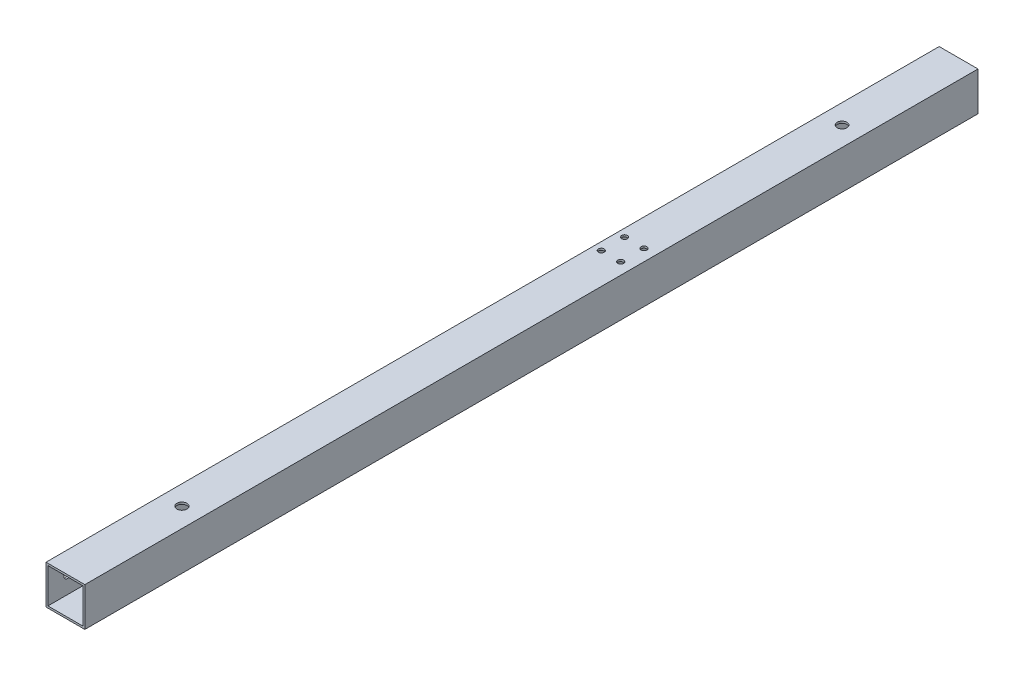
ISO-10303-21;
HEADER;
FILE_DESCRIPTION(('STEP AP214'),'2;1');
FILE_NAME('part.step','',(''),(''),'','','');
FILE_SCHEMA(('AUTOMOTIVE_DESIGN { 1 0 10303 214 1 1 1 1 }'));
ENDSEC;
DATA;
#1=APPLICATION_CONTEXT('core data for automotive mechanical design processes');
#2=APPLICATION_PROTOCOL_DEFINITION('international standard','automotive_design',2000,#1);
#3=PRODUCT_CONTEXT('',#1,'mechanical');
#4=PRODUCT('Part','Part','',(#3));
#5=PRODUCT_RELATED_PRODUCT_CATEGORY('part','',(#4));
#6=PRODUCT_DEFINITION_FORMATION('','',#4);
#7=PRODUCT_DEFINITION_CONTEXT('part definition',#1,'design');
#8=PRODUCT_DEFINITION('design','',#6,#7);
#9=PRODUCT_DEFINITION_SHAPE('','',#8);
#10=(LENGTH_UNIT() NAMED_UNIT(*) SI_UNIT(.MILLI.,.METRE.));
#11=(NAMED_UNIT(*) PLANE_ANGLE_UNIT() SI_UNIT($,.RADIAN.));
#12=(NAMED_UNIT(*) SI_UNIT($,.STERADIAN.) SOLID_ANGLE_UNIT());
#13=UNCERTAINTY_MEASURE_WITH_UNIT(LENGTH_MEASURE(1.E-05),#10,'distance_accuracy_value','');
#14=(GEOMETRIC_REPRESENTATION_CONTEXT(3) GLOBAL_UNCERTAINTY_ASSIGNED_CONTEXT((#13)) GLOBAL_UNIT_ASSIGNED_CONTEXT((#10,
#11,#12)) REPRESENTATION_CONTEXT('',''));
#15=CARTESIAN_POINT('',(0.,0.,0.));
#16=DIRECTION('',(0.,0.,1.));
#17=DIRECTION('',(1.,0.,0.));
#18=AXIS2_PLACEMENT_3D('',#15,#16,#17);
#19=CARTESIAN_POINT('',(0.,0.,460.));
#20=DIRECTION('',(0.,0.,1.));
#21=DIRECTION('',(1.,0.,0.));
#22=AXIS2_PLACEMENT_3D('',#19,#20,#21);
#23=PLANE('',#22);
#24=DIRECTION('',(0.,1.,0.));
#25=VECTOR('',#24,1.);
#26=CARTESIAN_POINT('',(10.,10.,460.));
#27=LINE('',#26,#25);
#28=CARTESIAN_POINT('',(10.,-10.,460.));
#29=VERTEX_POINT('',#28);
#30=CARTESIAN_POINT('',(10.,10.,460.));
#31=VERTEX_POINT('',#30);
#32=EDGE_CURVE('E144',#29,#31,#27,.T.);
#33=ORIENTED_EDGE('',*,*,#32,.T.);
#34=DIRECTION('',(-1.,0.,0.));
#35=VECTOR('',#34,1.);
#36=CARTESIAN_POINT('',(-10.,10.,460.));
#37=LINE('',#36,#35);
#38=CARTESIAN_POINT('',(-10.,10.,460.));
#39=VERTEX_POINT('',#38);
#40=EDGE_CURVE('E147',#31,#39,#37,.T.);
#41=ORIENTED_EDGE('',*,*,#40,.T.);
#42=DIRECTION('',(0.,-1.,0.));
#43=VECTOR('',#42,1.);
#44=CARTESIAN_POINT('',(-10.,10.,460.));
#45=LINE('',#44,#43);
#46=CARTESIAN_POINT('',(-10.,-10.,460.));
#47=VERTEX_POINT('',#46);
#48=EDGE_CURVE('E150',#39,#47,#45,.T.);
#49=ORIENTED_EDGE('',*,*,#48,.T.);
#50=DIRECTION('',(1.,0.,0.));
#51=VECTOR('',#50,1.);
#52=CARTESIAN_POINT('',(-10.,-10.,460.));
#53=LINE('',#52,#51);
#54=EDGE_CURVE('E152',#47,#29,#53,.T.);
#55=ORIENTED_EDGE('',*,*,#54,.T.);
#56=EDGE_LOOP('',(#33,#41,#49,#55));
#57=FACE_BOUND('',#56,.T.);
#58=DIRECTION('',(-1.,0.,0.));
#59=VECTOR('',#58,1.);
#60=CARTESIAN_POINT('',(-9.,9.,460.));
#61=LINE('',#60,#59);
#62=CARTESIAN_POINT('',(9.,9.,460.));
#63=VERTEX_POINT('',#62);
#64=CARTESIAN_POINT('',(-9.,9.,460.));
#65=VERTEX_POINT('',#64);
#66=EDGE_CURVE('E114',#63,#65,#61,.T.);
#67=ORIENTED_EDGE('',*,*,#66,.F.);
#68=DIRECTION('',(0.,1.,0.));
#69=VECTOR('',#68,1.);
#70=CARTESIAN_POINT('',(9.,9.,460.));
#71=LINE('',#70,#69);
#72=CARTESIAN_POINT('',(9.,-9.,460.));
#73=VERTEX_POINT('',#72);
#74=EDGE_CURVE('E106',#73,#63,#71,.T.);
#75=ORIENTED_EDGE('',*,*,#74,.F.);
#76=DIRECTION('',(1.,0.,0.));
#77=VECTOR('',#76,1.);
#78=CARTESIAN_POINT('',(-9.,-9.,460.));
#79=LINE('',#78,#77);
#80=CARTESIAN_POINT('',(-9.,-9.,460.));
#81=VERTEX_POINT('',#80);
#82=EDGE_CURVE('E128',#81,#73,#79,.T.);
#83=ORIENTED_EDGE('',*,*,#82,.F.);
#84=DIRECTION('',(0.,-1.,0.));
#85=VECTOR('',#84,1.);
#86=CARTESIAN_POINT('',(-9.,9.,460.));
#87=LINE('',#86,#85);
#88=EDGE_CURVE('E126',#65,#81,#87,.T.);
#89=ORIENTED_EDGE('',*,*,#88,.F.);
#90=EDGE_LOOP('',(#67,#75,#83,#89));
#91=FACE_BOUND('',#90,.T.);
#92=ADVANCED_FACE('F39',(#57,#91),#23,.T.);
#93=CARTESIAN_POINT('',(0.,0.,0.));
#94=DIRECTION('',(0.,0.,1.));
#95=DIRECTION('',(1.,0.,0.));
#96=AXIS2_PLACEMENT_3D('',#93,#94,#95);
#97=PLANE('',#96);
#98=DIRECTION('',(0.,1.,0.));
#99=VECTOR('',#98,1.);
#100=CARTESIAN_POINT('',(10.,10.,0.));
#101=LINE('',#100,#99);
#102=CARTESIAN_POINT('',(10.,-10.,0.));
#103=VERTEX_POINT('',#102);
#104=CARTESIAN_POINT('',(10.,10.,0.));
#105=VERTEX_POINT('',#104);
#106=EDGE_CURVE('E122',#103,#105,#101,.T.);
#107=ORIENTED_EDGE('',*,*,#106,.F.);
#108=DIRECTION('',(1.,0.,0.));
#109=VECTOR('',#108,1.);
#110=CARTESIAN_POINT('',(-10.,-10.,0.));
#111=LINE('',#110,#109);
#112=CARTESIAN_POINT('',(-10.,-10.,0.));
#113=VERTEX_POINT('',#112);
#114=EDGE_CURVE('E148',#113,#103,#111,.T.);
#115=ORIENTED_EDGE('',*,*,#114,.F.);
#116=DIRECTION('',(0.,-1.,0.));
#117=VECTOR('',#116,1.);
#118=CARTESIAN_POINT('',(-10.,10.,0.));
#119=LINE('',#118,#117);
#120=CARTESIAN_POINT('',(-10.,10.,0.));
#121=VERTEX_POINT('',#120);
#122=EDGE_CURVE('E159',#121,#113,#119,.T.);
#123=ORIENTED_EDGE('',*,*,#122,.F.);
#124=DIRECTION('',(-1.,0.,0.));
#125=VECTOR('',#124,1.);
#126=CARTESIAN_POINT('',(-10.,10.,0.));
#127=LINE('',#126,#125);
#128=EDGE_CURVE('E157',#105,#121,#127,.T.);
#129=ORIENTED_EDGE('',*,*,#128,.F.);
#130=EDGE_LOOP('',(#107,#115,#123,#129));
#131=FACE_BOUND('',#130,.T.);
#132=DIRECTION('',(0.,1.,0.));
#133=VECTOR('',#132,1.);
#134=CARTESIAN_POINT('',(9.,9.,0.));
#135=LINE('',#134,#133);
#136=CARTESIAN_POINT('',(9.,-9.,0.));
#137=VERTEX_POINT('',#136);
#138=CARTESIAN_POINT('',(9.,9.,0.));
#139=VERTEX_POINT('',#138);
#140=EDGE_CURVE('E64',#137,#139,#135,.T.);
#141=ORIENTED_EDGE('',*,*,#140,.T.);
#142=DIRECTION('',(-1.,0.,0.));
#143=VECTOR('',#142,1.);
#144=CARTESIAN_POINT('',(-9.,9.,0.));
#145=LINE('',#144,#143);
#146=CARTESIAN_POINT('',(-9.,9.,0.));
#147=VERTEX_POINT('',#146);
#148=EDGE_CURVE('E121',#139,#147,#145,.T.);
#149=ORIENTED_EDGE('',*,*,#148,.T.);
#150=DIRECTION('',(0.,-1.,0.));
#151=VECTOR('',#150,1.);
#152=CARTESIAN_POINT('',(-9.,9.,0.));
#153=LINE('',#152,#151);
#154=CARTESIAN_POINT('',(-9.,-9.,0.));
#155=VERTEX_POINT('',#154);
#156=EDGE_CURVE('E136',#147,#155,#153,.T.);
#157=ORIENTED_EDGE('',*,*,#156,.T.);
#158=DIRECTION('',(1.,0.,0.));
#159=VECTOR('',#158,1.);
#160=CARTESIAN_POINT('',(-9.,-9.,0.));
#161=LINE('',#160,#159);
#162=EDGE_CURVE('E115',#155,#137,#161,.T.);
#163=ORIENTED_EDGE('',*,*,#162,.T.);
#164=EDGE_LOOP('',(#141,#149,#157,#163));
#165=FACE_BOUND('',#164,.T.);
#166=ADVANCED_FACE('F277',(#131,#165),#97,.F.);
#167=CARTESIAN_POINT('',(10.,10.,460.));
#168=DIRECTION('',(-1.,0.,0.));
#169=DIRECTION('',(0.,0.,1.));
#170=AXIS2_PLACEMENT_3D('',#167,#168,#169);
#171=PLANE('',#170);
#172=ORIENTED_EDGE('',*,*,#106,.T.);
#173=DIRECTION('',(0.,0.,-1.));
#174=VECTOR('',#173,1.);
#175=CARTESIAN_POINT('',(10.,10.,460.));
#176=LINE('',#175,#174);
#177=EDGE_CURVE('E11',#31,#105,#176,.T.);
#178=ORIENTED_EDGE('',*,*,#177,.F.);
#179=ORIENTED_EDGE('',*,*,#32,.F.);
#180=DIRECTION('',(0.,0.,-1.));
#181=VECTOR('',#180,1.);
#182=CARTESIAN_POINT('',(10.,-10.,460.));
#183=LINE('',#182,#181);
#184=EDGE_CURVE('E154',#29,#103,#183,.T.);
#185=ORIENTED_EDGE('',*,*,#184,.T.);
#186=EDGE_LOOP('',(#172,#178,#179,#185));
#187=FACE_BOUND('',#186,.T.);
#188=ADVANCED_FACE('F41',(#187),#171,.F.);
#189=CARTESIAN_POINT('',(-10.,10.,460.));
#190=DIRECTION('',(0.,-1.,0.));
#191=DIRECTION('',(0.,0.,-1.));
#192=AXIS2_PLACEMENT_3D('',#189,#190,#191);
#193=PLANE('',#192);
#194=CARTESIAN_POINT('',(0.,10.,400.));
#195=DIRECTION('',(0.,-1.,0.));
#196=DIRECTION('',(0.,0.,-1.));
#197=AXIS2_PLACEMENT_3D('',#194,#195,#196);
#198=CIRCLE('',#197,2.6);
#199=CARTESIAN_POINT('',(0.,10.,397.4));
#200=VERTEX_POINT('',#199);
#201=EDGE_CURVE('E215',#200,#200,#198,.T.);
#202=ORIENTED_EDGE('',*,*,#201,.T.);
#203=EDGE_LOOP('',(#202));
#204=FACE_BOUND('',#203,.T.);
#205=CARTESIAN_POINT('',(0.,10.,60.));
#206=DIRECTION('',(0.,-1.,0.));
#207=DIRECTION('',(0.,0.,-1.));
#208=AXIS2_PLACEMENT_3D('',#205,#206,#207);
#209=CIRCLE('',#208,2.5);
#210=CARTESIAN_POINT('',(0.,10.,57.5));
#211=VERTEX_POINT('',#210);
#212=EDGE_CURVE('E203',#211,#211,#209,.T.);
#213=ORIENTED_EDGE('',*,*,#212,.T.);
#214=EDGE_LOOP('',(#213));
#215=FACE_BOUND('',#214,.T.);
#216=CARTESIAN_POINT('',(-6.00000000000231,10.,166.000000000001));
#217=DIRECTION('',(0.,1.,0.));
#218=DIRECTION('',(0.,0.,1.));
#219=AXIS2_PLACEMENT_3D('',#216,#217,#218);
#220=CIRCLE('',#219,1.50000000000001);
#221=CARTESIAN_POINT('',(-6.00000000000231,10.,167.500000000001));
#222=VERTEX_POINT('',#221);
#223=EDGE_CURVE('E230',#222,#222,#220,.T.);
#224=ORIENTED_EDGE('',*,*,#223,.F.);
#225=EDGE_LOOP('',(#224));
#226=FACE_BOUND('',#225,.T.);
#227=CARTESIAN_POINT('',(3.99999999999769,10.,178.000000000001));
#228=DIRECTION('',(0.,1.,0.));
#229=DIRECTION('',(0.,0.,1.));
#230=AXIS2_PLACEMENT_3D('',#227,#228,#229);
#231=CIRCLE('',#230,1.5);
#232=CARTESIAN_POINT('',(3.99999999999769,10.,179.500000000001));
#233=VERTEX_POINT('',#232);
#234=EDGE_CURVE('E223',#233,#233,#231,.T.);
#235=ORIENTED_EDGE('',*,*,#234,.F.);
#236=EDGE_LOOP('',(#235));
#237=FACE_BOUND('',#236,.T.);
#238=CARTESIAN_POINT('',(-6.00000000000231,10.,178.000000000001));
#239=DIRECTION('',(0.,1.,0.));
#240=DIRECTION('',(0.,0.,1.));
#241=AXIS2_PLACEMENT_3D('',#238,#239,#240);
#242=CIRCLE('',#241,1.5);
#243=CARTESIAN_POINT('',(-6.00000000000231,10.,179.500000000001));
#244=VERTEX_POINT('',#243);
#245=EDGE_CURVE('E207',#244,#244,#242,.T.);
#246=ORIENTED_EDGE('',*,*,#245,.F.);
#247=EDGE_LOOP('',(#246));
#248=FACE_BOUND('',#247,.T.);
#249=CARTESIAN_POINT('',(3.99999999999769,10.,166.000000000001));
#250=DIRECTION('',(0.,1.,0.));
#251=DIRECTION('',(0.,0.,1.));
#252=AXIS2_PLACEMENT_3D('',#249,#250,#251);
#253=CIRCLE('',#252,1.50000000000001);
#254=CARTESIAN_POINT('',(3.99999999999769,10.,167.500000000001));
#255=VERTEX_POINT('',#254);
#256=EDGE_CURVE('E229',#255,#255,#253,.T.);
#257=ORIENTED_EDGE('',*,*,#256,.F.);
#258=EDGE_LOOP('',(#257));
#259=FACE_BOUND('',#258,.T.);
#260=ORIENTED_EDGE('',*,*,#128,.T.);
#261=DIRECTION('',(0.,0.,-1.));
#262=VECTOR('',#261,1.);
#263=CARTESIAN_POINT('',(-10.,10.,460.));
#264=LINE('',#263,#262);
#265=EDGE_CURVE('E48',#39,#121,#264,.T.);
#266=ORIENTED_EDGE('',*,*,#265,.F.);
#267=ORIENTED_EDGE('',*,*,#40,.F.);
#268=ORIENTED_EDGE('',*,*,#177,.T.);
#269=EDGE_LOOP('',(#260,#266,#267,#268));
#270=FACE_BOUND('',#269,.T.);
#271=ADVANCED_FACE('F264',(#204,#215,#226,#237,#248,#259,#270),#193,.F.);
#272=CARTESIAN_POINT('',(-10.,10.,460.));
#273=DIRECTION('',(1.,0.,0.));
#274=DIRECTION('',(0.,1.,0.));
#275=AXIS2_PLACEMENT_3D('',#272,#273,#274);
#276=PLANE('',#275);
#277=CARTESIAN_POINT('',(-10.,0.,262.));
#278=DIRECTION('',(-1.,0.,0.));
#279=DIRECTION('',(0.,-1.,0.));
#280=AXIS2_PLACEMENT_3D('',#277,#278,#279);
#281=CIRCLE('',#280,1.80000000000001);
#282=CARTESIAN_POINT('',(-10.,-1.80000000000001,262.));
#283=VERTEX_POINT('',#282);
#284=EDGE_CURVE('E183',#283,#283,#281,.T.);
#285=ORIENTED_EDGE('',*,*,#284,.F.);
#286=EDGE_LOOP('',(#285));
#287=FACE_BOUND('',#286,.T.);
#288=CARTESIAN_POINT('',(-10.,0.,450.));
#289=DIRECTION('',(-1.,0.,0.));
#290=DIRECTION('',(0.,-1.,0.));
#291=AXIS2_PLACEMENT_3D('',#288,#289,#290);
#292=CIRCLE('',#291,1.80000000000001);
#293=CARTESIAN_POINT('',(-10.,-1.80000000000001,450.));
#294=VERTEX_POINT('',#293);
#295=EDGE_CURVE('E179',#294,#294,#292,.T.);
#296=ORIENTED_EDGE('',*,*,#295,.F.);
#297=EDGE_LOOP('',(#296));
#298=FACE_BOUND('',#297,.T.);
#299=CARTESIAN_POINT('',(-10.,0.,198.));
#300=DIRECTION('',(-1.,0.,0.));
#301=DIRECTION('',(0.,-1.,0.));
#302=AXIS2_PLACEMENT_3D('',#299,#300,#301);
#303=CIRCLE('',#302,1.80000000000001);
#304=CARTESIAN_POINT('',(-10.,-1.80000000000001,198.));
#305=VERTEX_POINT('',#304);
#306=EDGE_CURVE('E175',#305,#305,#303,.T.);
#307=ORIENTED_EDGE('',*,*,#306,.F.);
#308=EDGE_LOOP('',(#307));
#309=FACE_BOUND('',#308,.T.);
#310=CARTESIAN_POINT('',(-10.,0.,10.));
#311=DIRECTION('',(-1.,0.,0.));
#312=DIRECTION('',(0.,-1.,0.));
#313=AXIS2_PLACEMENT_3D('',#310,#311,#312);
#314=CIRCLE('',#313,1.8);
#315=CARTESIAN_POINT('',(-10.,-1.8,10.));
#316=VERTEX_POINT('',#315);
#317=EDGE_CURVE('E171',#316,#316,#314,.T.);
#318=ORIENTED_EDGE('',*,*,#317,.F.);
#319=EDGE_LOOP('',(#318));
#320=FACE_BOUND('',#319,.T.);
#321=ORIENTED_EDGE('',*,*,#122,.T.);
#322=DIRECTION('',(0.,0.,-1.));
#323=VECTOR('',#322,1.);
#324=CARTESIAN_POINT('',(-10.,-10.,460.));
#325=LINE('',#324,#323);
#326=EDGE_CURVE('E164',#47,#113,#325,.T.);
#327=ORIENTED_EDGE('',*,*,#326,.F.);
#328=ORIENTED_EDGE('',*,*,#48,.F.);
#329=ORIENTED_EDGE('',*,*,#265,.T.);
#330=EDGE_LOOP('',(#321,#327,#328,#329));
#331=FACE_BOUND('',#330,.T.);
#332=ADVANCED_FACE('F260',(#287,#298,#309,#320,#331),#276,.F.);
#333=CARTESIAN_POINT('',(-10.,-10.,460.));
#334=DIRECTION('',(0.,1.,0.));
#335=DIRECTION('',(0.,0.,1.));
#336=AXIS2_PLACEMENT_3D('',#333,#334,#335);
#337=PLANE('',#336);
#338=CARTESIAN_POINT('',(0.,-10.,400.));
#339=DIRECTION('',(0.,-1.,0.));
#340=DIRECTION('',(0.,0.,-1.));
#341=AXIS2_PLACEMENT_3D('',#338,#339,#340);
#342=CIRCLE('',#341,2.6);
#343=CARTESIAN_POINT('',(0.,-10.,397.4));
#344=VERTEX_POINT('',#343);
#345=EDGE_CURVE('E309',#344,#344,#342,.T.);
#346=ORIENTED_EDGE('',*,*,#345,.F.);
#347=EDGE_LOOP('',(#346));
#348=FACE_BOUND('',#347,.T.);
#349=CARTESIAN_POINT('',(0.,-10.,60.));
#350=DIRECTION('',(0.,-1.,0.));
#351=DIRECTION('',(0.,0.,-1.));
#352=AXIS2_PLACEMENT_3D('',#349,#350,#351);
#353=CIRCLE('',#352,2.5);
#354=CARTESIAN_POINT('',(0.,-10.,57.5));
#355=VERTEX_POINT('',#354);
#356=EDGE_CURVE('E210',#355,#355,#353,.T.);
#357=ORIENTED_EDGE('',*,*,#356,.F.);
#358=EDGE_LOOP('',(#357));
#359=FACE_BOUND('',#358,.T.);
#360=CARTESIAN_POINT('',(-6.00000000000231,-10.,166.000000000001));
#361=DIRECTION('',(0.,1.,0.));
#362=DIRECTION('',(0.,0.,1.));
#363=AXIS2_PLACEMENT_3D('',#360,#361,#362);
#364=CIRCLE('',#363,1.50000000000001);
#365=CARTESIAN_POINT('',(-6.00000000000231,-10.,167.500000000001));
#366=VERTEX_POINT('',#365);
#367=EDGE_CURVE('E226',#366,#366,#364,.T.);
#368=ORIENTED_EDGE('',*,*,#367,.T.);
#369=EDGE_LOOP('',(#368));
#370=FACE_BOUND('',#369,.T.);
#371=CARTESIAN_POINT('',(3.99999999999769,-10.,178.000000000001));
#372=DIRECTION('',(0.,1.,0.));
#373=DIRECTION('',(0.,0.,1.));
#374=AXIS2_PLACEMENT_3D('',#371,#372,#373);
#375=CIRCLE('',#374,1.5);
#376=CARTESIAN_POINT('',(3.99999999999769,-10.,179.500000000001));
#377=VERTEX_POINT('',#376);
#378=EDGE_CURVE('E233',#377,#377,#375,.T.);
#379=ORIENTED_EDGE('',*,*,#378,.T.);
#380=EDGE_LOOP('',(#379));
#381=FACE_BOUND('',#380,.T.);
#382=CARTESIAN_POINT('',(-6.00000000000231,-10.,178.000000000001));
#383=DIRECTION('',(0.,1.,0.));
#384=DIRECTION('',(0.,0.,1.));
#385=AXIS2_PLACEMENT_3D('',#382,#383,#384);
#386=CIRCLE('',#385,1.5);
#387=CARTESIAN_POINT('',(-6.00000000000231,-10.,179.500000000001));
#388=VERTEX_POINT('',#387);
#389=EDGE_CURVE('E220',#388,#388,#386,.T.);
#390=ORIENTED_EDGE('',*,*,#389,.T.);
#391=EDGE_LOOP('',(#390));
#392=FACE_BOUND('',#391,.T.);
#393=CARTESIAN_POINT('',(3.99999999999769,-10.,166.000000000001));
#394=DIRECTION('',(0.,1.,0.));
#395=DIRECTION('',(0.,0.,1.));
#396=AXIS2_PLACEMENT_3D('',#393,#394,#395);
#397=CIRCLE('',#396,1.50000000000001);
#398=CARTESIAN_POINT('',(3.99999999999769,-10.,167.500000000001));
#399=VERTEX_POINT('',#398);
#400=EDGE_CURVE('E188',#399,#399,#397,.T.);
#401=ORIENTED_EDGE('',*,*,#400,.T.);
#402=EDGE_LOOP('',(#401));
#403=FACE_BOUND('',#402,.T.);
#404=ORIENTED_EDGE('',*,*,#114,.T.);
#405=ORIENTED_EDGE('',*,*,#184,.F.);
#406=ORIENTED_EDGE('',*,*,#54,.F.);
#407=ORIENTED_EDGE('',*,*,#326,.T.);
#408=EDGE_LOOP('',(#404,#405,#406,#407));
#409=FACE_BOUND('',#408,.T.);
#410=ADVANCED_FACE('F263',(#348,#359,#370,#381,#392,#403,#409),#337,.F.);
#411=CARTESIAN_POINT('',(9.,9.,460.));
#412=DIRECTION('',(-1.,0.,0.));
#413=DIRECTION('',(0.,0.,1.));
#414=AXIS2_PLACEMENT_3D('',#411,#412,#413);
#415=PLANE('',#414);
#416=ORIENTED_EDGE('',*,*,#140,.F.);
#417=DIRECTION('',(0.,0.,-1.));
#418=VECTOR('',#417,1.);
#419=CARTESIAN_POINT('',(9.,-9.,460.));
#420=LINE('',#419,#418);
#421=EDGE_CURVE('E110',#73,#137,#420,.T.);
#422=ORIENTED_EDGE('',*,*,#421,.F.);
#423=ORIENTED_EDGE('',*,*,#74,.T.);
#424=DIRECTION('',(0.,0.,-1.));
#425=VECTOR('',#424,1.);
#426=CARTESIAN_POINT('',(9.,9.,460.));
#427=LINE('',#426,#425);
#428=EDGE_CURVE('E109',#63,#139,#427,.T.);
#429=ORIENTED_EDGE('',*,*,#428,.T.);
#430=EDGE_LOOP('',(#416,#422,#423,#429));
#431=FACE_BOUND('',#430,.T.);
#432=ADVANCED_FACE('F108',(#431),#415,.T.);
#433=CARTESIAN_POINT('',(-9.,9.,460.));
#434=DIRECTION('',(0.,-1.,0.));
#435=DIRECTION('',(0.,0.,-1.));
#436=AXIS2_PLACEMENT_3D('',#433,#434,#435);
#437=PLANE('',#436);
#438=CARTESIAN_POINT('',(0.,9.,400.));
#439=DIRECTION('',(0.,-1.,0.));
#440=DIRECTION('',(0.,0.,-1.));
#441=AXIS2_PLACEMENT_3D('',#438,#439,#440);
#442=CIRCLE('',#441,2.6);
#443=CARTESIAN_POINT('',(0.,9.,397.4));
#444=VERTEX_POINT('',#443);
#445=EDGE_CURVE('E495',#444,#444,#442,.T.);
#446=ORIENTED_EDGE('',*,*,#445,.F.);
#447=EDGE_LOOP('',(#446));
#448=FACE_BOUND('',#447,.T.);
#449=CARTESIAN_POINT('',(0.,9.,60.));
#450=DIRECTION('',(0.,-1.,0.));
#451=DIRECTION('',(0.,0.,-1.));
#452=AXIS2_PLACEMENT_3D('',#449,#450,#451);
#453=CIRCLE('',#452,2.5);
#454=CARTESIAN_POINT('',(0.,9.,57.5));
#455=VERTEX_POINT('',#454);
#456=EDGE_CURVE('E202',#455,#455,#453,.T.);
#457=ORIENTED_EDGE('',*,*,#456,.F.);
#458=EDGE_LOOP('',(#457));
#459=FACE_BOUND('',#458,.T.);
#460=CARTESIAN_POINT('',(-6.00000000000231,9.,166.000000000001));
#461=DIRECTION('',(0.,-1.,0.));
#462=DIRECTION('',(0.,0.,-1.));
#463=AXIS2_PLACEMENT_3D('',#460,#461,#462);
#464=CIRCLE('',#463,1.50000000000001);
#465=CARTESIAN_POINT('',(-6.00000000000231,9.,164.500000000001));
#466=VERTEX_POINT('',#465);
#467=EDGE_CURVE('E199',#466,#466,#464,.T.);
#468=ORIENTED_EDGE('',*,*,#467,.F.);
#469=EDGE_LOOP('',(#468));
#470=FACE_BOUND('',#469,.T.);
#471=CARTESIAN_POINT('',(3.99999999999769,9.,178.000000000001));
#472=DIRECTION('',(0.,-1.,0.));
#473=DIRECTION('',(0.,0.,-1.));
#474=AXIS2_PLACEMENT_3D('',#471,#472,#473);
#475=CIRCLE('',#474,1.5);
#476=CARTESIAN_POINT('',(3.99999999999769,9.,176.500000000001));
#477=VERTEX_POINT('',#476);
#478=EDGE_CURVE('E196',#477,#477,#475,.T.);
#479=ORIENTED_EDGE('',*,*,#478,.F.);
#480=EDGE_LOOP('',(#479));
#481=FACE_BOUND('',#480,.T.);
#482=CARTESIAN_POINT('',(-6.00000000000231,9.,178.000000000001));
#483=DIRECTION('',(0.,-1.,0.));
#484=DIRECTION('',(0.,0.,-1.));
#485=AXIS2_PLACEMENT_3D('',#482,#483,#484);
#486=CIRCLE('',#485,1.5);
#487=CARTESIAN_POINT('',(-6.00000000000231,9.,176.500000000001));
#488=VERTEX_POINT('',#487);
#489=EDGE_CURVE('E192',#488,#488,#486,.T.);
#490=ORIENTED_EDGE('',*,*,#489,.F.);
#491=EDGE_LOOP('',(#490));
#492=FACE_BOUND('',#491,.T.);
#493=CARTESIAN_POINT('',(3.99999999999769,9.,166.000000000001));
#494=DIRECTION('',(0.,-1.,0.));
#495=DIRECTION('',(0.,0.,-1.));
#496=AXIS2_PLACEMENT_3D('',#493,#494,#495);
#497=CIRCLE('',#496,1.50000000000001);
#498=CARTESIAN_POINT('',(3.99999999999769,9.,164.500000000001));
#499=VERTEX_POINT('',#498);
#500=EDGE_CURVE('E187',#499,#499,#497,.T.);
#501=ORIENTED_EDGE('',*,*,#500,.F.);
#502=EDGE_LOOP('',(#501));
#503=FACE_BOUND('',#502,.T.);
#504=ORIENTED_EDGE('',*,*,#148,.F.);
#505=ORIENTED_EDGE('',*,*,#428,.F.);
#506=ORIENTED_EDGE('',*,*,#66,.T.);
#507=DIRECTION('',(0.,0.,-1.));
#508=VECTOR('',#507,1.);
#509=CARTESIAN_POINT('',(-9.,9.,460.));
#510=LINE('',#509,#508);
#511=EDGE_CURVE('E123',#65,#147,#510,.T.);
#512=ORIENTED_EDGE('',*,*,#511,.T.);
#513=EDGE_LOOP('',(#504,#505,#506,#512));
#514=FACE_BOUND('',#513,.T.);
#515=ADVANCED_FACE('F118',(#448,#459,#470,#481,#492,#503,#514),#437,.T.);
#516=CARTESIAN_POINT('',(-9.,9.,460.));
#517=DIRECTION('',(1.,0.,0.));
#518=DIRECTION('',(0.,0.,-1.));
#519=AXIS2_PLACEMENT_3D('',#516,#517,#518);
#520=PLANE('',#519);
#521=CARTESIAN_POINT('',(-9.,0.,262.));
#522=DIRECTION('',(1.,0.,0.));
#523=DIRECTION('',(0.,0.,-1.));
#524=AXIS2_PLACEMENT_3D('',#521,#522,#523);
#525=CIRCLE('',#524,1.80000000000001);
#526=CARTESIAN_POINT('',(-9.,0.,260.2));
#527=VERTEX_POINT('',#526);
#528=EDGE_CURVE('E180',#527,#527,#525,.T.);
#529=ORIENTED_EDGE('',*,*,#528,.F.);
#530=EDGE_LOOP('',(#529));
#531=FACE_BOUND('',#530,.T.);
#532=CARTESIAN_POINT('',(-9.,0.,450.));
#533=DIRECTION('',(1.,0.,0.));
#534=DIRECTION('',(0.,0.,-1.));
#535=AXIS2_PLACEMENT_3D('',#532,#533,#534);
#536=CIRCLE('',#535,1.80000000000001);
#537=CARTESIAN_POINT('',(-9.,0.,448.2));
#538=VERTEX_POINT('',#537);
#539=EDGE_CURVE('E176',#538,#538,#536,.T.);
#540=ORIENTED_EDGE('',*,*,#539,.F.);
#541=EDGE_LOOP('',(#540));
#542=FACE_BOUND('',#541,.T.);
#543=CARTESIAN_POINT('',(-9.,0.,198.));
#544=DIRECTION('',(1.,0.,0.));
#545=DIRECTION('',(0.,0.,-1.));
#546=AXIS2_PLACEMENT_3D('',#543,#544,#545);
#547=CIRCLE('',#546,1.80000000000001);
#548=CARTESIAN_POINT('',(-9.,0.,196.2));
#549=VERTEX_POINT('',#548);
#550=EDGE_CURVE('E172',#549,#549,#547,.T.);
#551=ORIENTED_EDGE('',*,*,#550,.F.);
#552=EDGE_LOOP('',(#551));
#553=FACE_BOUND('',#552,.T.);
#554=CARTESIAN_POINT('',(-9.,0.,10.));
#555=DIRECTION('',(1.,0.,0.));
#556=DIRECTION('',(0.,0.,-1.));
#557=AXIS2_PLACEMENT_3D('',#554,#555,#556);
#558=CIRCLE('',#557,1.8);
#559=CARTESIAN_POINT('',(-9.,0.,8.2));
#560=VERTEX_POINT('',#559);
#561=EDGE_CURVE('E134',#560,#560,#558,.T.);
#562=ORIENTED_EDGE('',*,*,#561,.F.);
#563=EDGE_LOOP('',(#562));
#564=FACE_BOUND('',#563,.T.);
#565=ORIENTED_EDGE('',*,*,#156,.F.);
#566=ORIENTED_EDGE('',*,*,#511,.F.);
#567=ORIENTED_EDGE('',*,*,#88,.T.);
#568=DIRECTION('',(0.,0.,-1.));
#569=VECTOR('',#568,1.);
#570=CARTESIAN_POINT('',(-9.,-9.,460.));
#571=LINE('',#570,#569);
#572=EDGE_CURVE('E56',#81,#155,#571,.T.);
#573=ORIENTED_EDGE('',*,*,#572,.T.);
#574=EDGE_LOOP('',(#565,#566,#567,#573));
#575=FACE_BOUND('',#574,.T.);
#576=ADVANCED_FACE('F356',(#531,#542,#553,#564,#575),#520,.T.);
#577=CARTESIAN_POINT('',(-9.,-9.,460.));
#578=DIRECTION('',(0.,1.,0.));
#579=DIRECTION('',(0.,0.,1.));
#580=AXIS2_PLACEMENT_3D('',#577,#578,#579);
#581=PLANE('',#580);
#582=CARTESIAN_POINT('',(0.,-9.,400.));
#583=DIRECTION('',(0.,1.,0.));
#584=DIRECTION('',(0.,0.,1.));
#585=AXIS2_PLACEMENT_3D('',#582,#583,#584);
#586=CIRCLE('',#585,2.6);
#587=CARTESIAN_POINT('',(0.,-9.,402.6));
#588=VERTEX_POINT('',#587);
#589=EDGE_CURVE('E43',#588,#588,#586,.T.);
#590=ORIENTED_EDGE('',*,*,#589,.F.);
#591=EDGE_LOOP('',(#590));
#592=FACE_BOUND('',#591,.T.);
#593=CARTESIAN_POINT('',(0.,-9.,60.));
#594=DIRECTION('',(0.,1.,0.));
#595=DIRECTION('',(0.,0.,1.));
#596=AXIS2_PLACEMENT_3D('',#593,#594,#595);
#597=CIRCLE('',#596,2.5);
#598=CARTESIAN_POINT('',(0.,-9.,62.5));
#599=VERTEX_POINT('',#598);
#600=EDGE_CURVE('E200',#599,#599,#597,.T.);
#601=ORIENTED_EDGE('',*,*,#600,.F.);
#602=EDGE_LOOP('',(#601));
#603=FACE_BOUND('',#602,.T.);
#604=CARTESIAN_POINT('',(-6.00000000000231,-9.,166.000000000001));
#605=DIRECTION('',(0.,1.,0.));
#606=DIRECTION('',(0.,0.,1.));
#607=AXIS2_PLACEMENT_3D('',#604,#605,#606);
#608=CIRCLE('',#607,1.50000000000001);
#609=CARTESIAN_POINT('',(-6.00000000000231,-9.,167.500000000001));
#610=VERTEX_POINT('',#609);
#611=EDGE_CURVE('E197',#610,#610,#608,.T.);
#612=ORIENTED_EDGE('',*,*,#611,.F.);
#613=EDGE_LOOP('',(#612));
#614=FACE_BOUND('',#613,.T.);
#615=CARTESIAN_POINT('',(3.99999999999769,-9.,178.000000000001));
#616=DIRECTION('',(0.,1.,0.));
#617=DIRECTION('',(0.,0.,1.));
#618=AXIS2_PLACEMENT_3D('',#615,#616,#617);
#619=CIRCLE('',#618,1.5);
#620=CARTESIAN_POINT('',(3.99999999999769,-9.,179.500000000001));
#621=VERTEX_POINT('',#620);
#622=EDGE_CURVE('E193',#621,#621,#619,.T.);
#623=ORIENTED_EDGE('',*,*,#622,.F.);
#624=EDGE_LOOP('',(#623));
#625=FACE_BOUND('',#624,.T.);
#626=CARTESIAN_POINT('',(-6.00000000000231,-9.,178.000000000001));
#627=DIRECTION('',(0.,1.,0.));
#628=DIRECTION('',(0.,0.,1.));
#629=AXIS2_PLACEMENT_3D('',#626,#627,#628);
#630=CIRCLE('',#629,1.5);
#631=CARTESIAN_POINT('',(-6.00000000000231,-9.,179.500000000001));
#632=VERTEX_POINT('',#631);
#633=EDGE_CURVE('E189',#632,#632,#630,.T.);
#634=ORIENTED_EDGE('',*,*,#633,.F.);
#635=EDGE_LOOP('',(#634));
#636=FACE_BOUND('',#635,.T.);
#637=CARTESIAN_POINT('',(3.99999999999769,-9.,166.000000000001));
#638=DIRECTION('',(0.,1.,0.));
#639=DIRECTION('',(0.,0.,1.));
#640=AXIS2_PLACEMENT_3D('',#637,#638,#639);
#641=CIRCLE('',#640,1.50000000000001);
#642=CARTESIAN_POINT('',(3.99999999999769,-9.,167.500000000001));
#643=VERTEX_POINT('',#642);
#644=EDGE_CURVE('E184',#643,#643,#641,.T.);
#645=ORIENTED_EDGE('',*,*,#644,.F.);
#646=EDGE_LOOP('',(#645));
#647=FACE_BOUND('',#646,.T.);
#648=ORIENTED_EDGE('',*,*,#162,.F.);
#649=ORIENTED_EDGE('',*,*,#572,.F.);
#650=ORIENTED_EDGE('',*,*,#82,.T.);
#651=ORIENTED_EDGE('',*,*,#421,.T.);
#652=EDGE_LOOP('',(#648,#649,#650,#651));
#653=FACE_BOUND('',#652,.T.);
#654=ADVANCED_FACE('F362',(#592,#603,#614,#625,#636,#647,#653),#581,.T.);
#655=CARTESIAN_POINT('',(-7.,0.,10.));
#656=DIRECTION('',(-1.,0.,0.));
#657=DIRECTION('',(0.,-1.,0.));
#658=AXIS2_PLACEMENT_3D('',#655,#656,#657);
#659=CYLINDRICAL_SURFACE('',#658,1.8);
#660=ORIENTED_EDGE('',*,*,#561,.T.);
#661=EDGE_LOOP('',(#660));
#662=FACE_BOUND('',#661,.T.);
#663=ORIENTED_EDGE('',*,*,#317,.T.);
#664=EDGE_LOOP('',(#663));
#665=FACE_BOUND('',#664,.T.);
#666=ADVANCED_FACE('F258',(#662,#665),#659,.F.);
#667=CARTESIAN_POINT('',(-7.,0.,198.));
#668=DIRECTION('',(-1.,0.,0.));
#669=DIRECTION('',(0.,-1.,0.));
#670=AXIS2_PLACEMENT_3D('',#667,#668,#669);
#671=CYLINDRICAL_SURFACE('',#670,1.80000000000001);
#672=ORIENTED_EDGE('',*,*,#550,.T.);
#673=EDGE_LOOP('',(#672));
#674=FACE_BOUND('',#673,.T.);
#675=ORIENTED_EDGE('',*,*,#306,.T.);
#676=EDGE_LOOP('',(#675));
#677=FACE_BOUND('',#676,.T.);
#678=ADVANCED_FACE('F372',(#674,#677),#671,.F.);
#679=CARTESIAN_POINT('',(-7.,0.,450.));
#680=DIRECTION('',(-1.,0.,0.));
#681=DIRECTION('',(0.,-1.,0.));
#682=AXIS2_PLACEMENT_3D('',#679,#680,#681);
#683=CYLINDRICAL_SURFACE('',#682,1.80000000000001);
#684=ORIENTED_EDGE('',*,*,#539,.T.);
#685=EDGE_LOOP('',(#684));
#686=FACE_BOUND('',#685,.T.);
#687=ORIENTED_EDGE('',*,*,#295,.T.);
#688=EDGE_LOOP('',(#687));
#689=FACE_BOUND('',#688,.T.);
#690=ADVANCED_FACE('F335',(#686,#689),#683,.F.);
#691=CARTESIAN_POINT('',(0.,0.,262.));
#692=DIRECTION('',(-1.,0.,0.));
#693=DIRECTION('',(0.,-1.,0.));
#694=AXIS2_PLACEMENT_3D('',#691,#692,#693);
#695=CYLINDRICAL_SURFACE('',#694,1.80000000000001);
#696=ORIENTED_EDGE('',*,*,#528,.T.);
#697=EDGE_LOOP('',(#696));
#698=FACE_BOUND('',#697,.T.);
#699=ORIENTED_EDGE('',*,*,#284,.T.);
#700=EDGE_LOOP('',(#699));
#701=FACE_BOUND('',#700,.T.);
#702=ADVANCED_FACE('F323',(#698,#701),#695,.F.);
#703=CARTESIAN_POINT('',(3.99999999999769,-10.,166.000000000001));
#704=DIRECTION('',(0.,1.,0.));
#705=DIRECTION('',(0.,0.,1.));
#706=AXIS2_PLACEMENT_3D('',#703,#704,#705);
#707=CYLINDRICAL_SURFACE('',#706,1.50000000000001);
#708=ORIENTED_EDGE('',*,*,#644,.T.);
#709=EDGE_LOOP('',(#708));
#710=FACE_BOUND('',#709,.T.);
#711=ORIENTED_EDGE('',*,*,#400,.F.);
#712=EDGE_LOOP('',(#711));
#713=FACE_BOUND('',#712,.T.);
#714=ADVANCED_FACE('F320',(#710,#713),#707,.F.);
#715=CARTESIAN_POINT('',(-6.00000000000231,-10.,178.000000000001));
#716=DIRECTION('',(0.,1.,0.));
#717=DIRECTION('',(0.,0.,1.));
#718=AXIS2_PLACEMENT_3D('',#715,#716,#717);
#719=CYLINDRICAL_SURFACE('',#718,1.5);
#720=ORIENTED_EDGE('',*,*,#633,.T.);
#721=EDGE_LOOP('',(#720));
#722=FACE_BOUND('',#721,.T.);
#723=ORIENTED_EDGE('',*,*,#389,.F.);
#724=EDGE_LOOP('',(#723));
#725=FACE_BOUND('',#724,.T.);
#726=ADVANCED_FACE('F322',(#722,#725),#719,.F.);
#727=CARTESIAN_POINT('',(3.99999999999769,-10.,178.000000000001));
#728=DIRECTION('',(0.,1.,0.));
#729=DIRECTION('',(0.,0.,1.));
#730=AXIS2_PLACEMENT_3D('',#727,#728,#729);
#731=CYLINDRICAL_SURFACE('',#730,1.5);
#732=ORIENTED_EDGE('',*,*,#622,.T.);
#733=EDGE_LOOP('',(#732));
#734=FACE_BOUND('',#733,.T.);
#735=ORIENTED_EDGE('',*,*,#378,.F.);
#736=EDGE_LOOP('',(#735));
#737=FACE_BOUND('',#736,.T.);
#738=ADVANCED_FACE('F331',(#734,#737),#731,.F.);
#739=CARTESIAN_POINT('',(-6.00000000000231,-10.,166.000000000001));
#740=DIRECTION('',(0.,1.,0.));
#741=DIRECTION('',(0.,0.,1.));
#742=AXIS2_PLACEMENT_3D('',#739,#740,#741);
#743=CYLINDRICAL_SURFACE('',#742,1.50000000000001);
#744=ORIENTED_EDGE('',*,*,#611,.T.);
#745=EDGE_LOOP('',(#744));
#746=FACE_BOUND('',#745,.T.);
#747=ORIENTED_EDGE('',*,*,#367,.F.);
#748=EDGE_LOOP('',(#747));
#749=FACE_BOUND('',#748,.T.);
#750=ADVANCED_FACE('F340',(#746,#749),#743,.F.);
#751=ORIENTED_EDGE('',*,*,#500,.T.);
#752=EDGE_LOOP('',(#751));
#753=FACE_BOUND('',#752,.T.);
#754=ORIENTED_EDGE('',*,*,#256,.T.);
#755=EDGE_LOOP('',(#754));
#756=FACE_BOUND('',#755,.T.);
#757=ADVANCED_FACE('F326',(#753,#756),#707,.F.);
#758=ORIENTED_EDGE('',*,*,#489,.T.);
#759=EDGE_LOOP('',(#758));
#760=FACE_BOUND('',#759,.T.);
#761=ORIENTED_EDGE('',*,*,#245,.T.);
#762=EDGE_LOOP('',(#761));
#763=FACE_BOUND('',#762,.T.);
#764=ADVANCED_FACE('F334',(#760,#763),#719,.F.);
#765=ORIENTED_EDGE('',*,*,#478,.T.);
#766=EDGE_LOOP('',(#765));
#767=FACE_BOUND('',#766,.T.);
#768=ORIENTED_EDGE('',*,*,#234,.T.);
#769=EDGE_LOOP('',(#768));
#770=FACE_BOUND('',#769,.T.);
#771=ADVANCED_FACE('F346',(#767,#770),#731,.F.);
#772=ORIENTED_EDGE('',*,*,#467,.T.);
#773=EDGE_LOOP('',(#772));
#774=FACE_BOUND('',#773,.T.);
#775=ORIENTED_EDGE('',*,*,#223,.T.);
#776=EDGE_LOOP('',(#775));
#777=FACE_BOUND('',#776,.T.);
#778=ADVANCED_FACE('F350',(#774,#777),#743,.F.);
#779=CARTESIAN_POINT('',(0.,10.,60.));
#780=DIRECTION('',(0.,-1.,0.));
#781=DIRECTION('',(0.,0.,-1.));
#782=AXIS2_PLACEMENT_3D('',#779,#780,#781);
#783=CYLINDRICAL_SURFACE('',#782,2.5);
#784=ORIENTED_EDGE('',*,*,#600,.T.);
#785=EDGE_LOOP('',(#784));
#786=FACE_BOUND('',#785,.T.);
#787=ORIENTED_EDGE('',*,*,#356,.T.);
#788=EDGE_LOOP('',(#787));
#789=FACE_BOUND('',#788,.T.);
#790=ADVANCED_FACE('F454',(#786,#789),#783,.F.);
#791=ORIENTED_EDGE('',*,*,#456,.T.);
#792=EDGE_LOOP('',(#791));
#793=FACE_BOUND('',#792,.T.);
#794=ORIENTED_EDGE('',*,*,#212,.F.);
#795=EDGE_LOOP('',(#794));
#796=FACE_BOUND('',#795,.T.);
#797=ADVANCED_FACE('F462',(#793,#796),#783,.F.);
#798=CARTESIAN_POINT('',(0.,26.,400.));
#799=DIRECTION('',(0.,-1.,0.));
#800=DIRECTION('',(0.,0.,-1.));
#801=AXIS2_PLACEMENT_3D('',#798,#799,#800);
#802=CYLINDRICAL_SURFACE('',#801,2.6);
#803=ORIENTED_EDGE('',*,*,#589,.T.);
#804=EDGE_LOOP('',(#803));
#805=FACE_BOUND('',#804,.T.);
#806=ORIENTED_EDGE('',*,*,#345,.T.);
#807=EDGE_LOOP('',(#806));
#808=FACE_BOUND('',#807,.T.);
#809=ADVANCED_FACE('F470',(#805,#808),#802,.F.);
#810=ORIENTED_EDGE('',*,*,#445,.T.);
#811=EDGE_LOOP('',(#810));
#812=FACE_BOUND('',#811,.T.);
#813=ORIENTED_EDGE('',*,*,#201,.F.);
#814=EDGE_LOOP('',(#813));
#815=FACE_BOUND('',#814,.T.);
#816=ADVANCED_FACE('F480',(#812,#815),#802,.F.);
#817=CLOSED_SHELL('',(#92,#166,#188,#271,#332,#410,#432,#515,#576,#654,#666,#678,#690,#702,#714,
#726,#738,#750,#757,#764,#771,#778,#790,#797,#809,#816));
#818=MANIFOLD_SOLID_BREP('B2',#817);
#819=ADVANCED_BREP_SHAPE_REPRESENTATION('',(#18,#818),#14);
#820=SHAPE_DEFINITION_REPRESENTATION(#9,#819);
ENDSEC;
END-ISO-10303-21;
